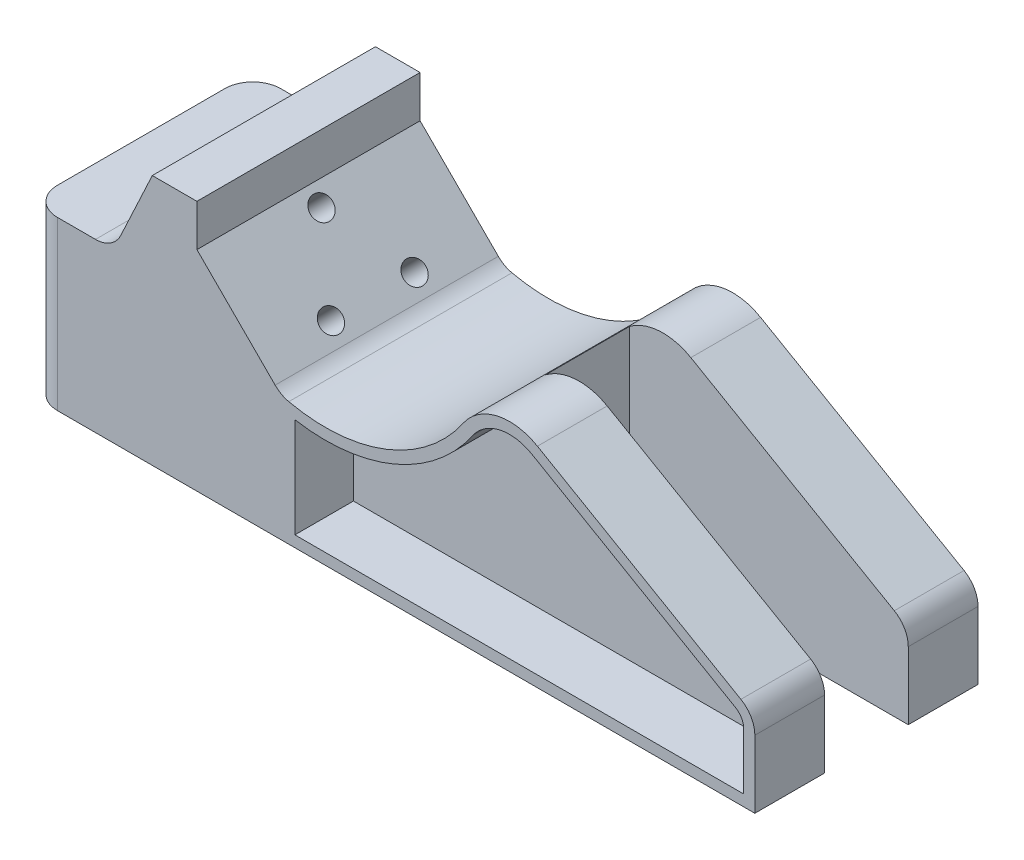
ISO-10303-21;
HEADER;
FILE_DESCRIPTION(('STEP AP214'),'2;1');
FILE_NAME('part.step','',(''),(''),'','','');
FILE_SCHEMA(('AUTOMOTIVE_DESIGN { 1 0 10303 214 1 1 1 1 }'));
ENDSEC;
DATA;
#1=APPLICATION_CONTEXT('core data for automotive mechanical design processes');
#2=APPLICATION_PROTOCOL_DEFINITION('international standard','automotive_design',2000,#1);
#3=PRODUCT_CONTEXT('',#1,'mechanical');
#4=PRODUCT('Part','Part','',(#3));
#5=PRODUCT_RELATED_PRODUCT_CATEGORY('part','',(#4));
#6=PRODUCT_DEFINITION_FORMATION('','',#4);
#7=PRODUCT_DEFINITION_CONTEXT('part definition',#1,'design');
#8=PRODUCT_DEFINITION('design','',#6,#7);
#9=PRODUCT_DEFINITION_SHAPE('','',#8);
#10=(LENGTH_UNIT() NAMED_UNIT(*) SI_UNIT(.MILLI.,.METRE.));
#11=(NAMED_UNIT(*) PLANE_ANGLE_UNIT() SI_UNIT($,.RADIAN.));
#12=(NAMED_UNIT(*) SI_UNIT($,.STERADIAN.) SOLID_ANGLE_UNIT());
#13=UNCERTAINTY_MEASURE_WITH_UNIT(LENGTH_MEASURE(1.E-05),#10,'distance_accuracy_value','');
#14=(GEOMETRIC_REPRESENTATION_CONTEXT(3) GLOBAL_UNCERTAINTY_ASSIGNED_CONTEXT((#13)) GLOBAL_UNIT_ASSIGNED_CONTEXT((#10,
#11,#12)) REPRESENTATION_CONTEXT('',''));
#15=CARTESIAN_POINT('',(0.,0.,0.));
#16=DIRECTION('',(0.,0.,1.));
#17=DIRECTION('',(1.,0.,0.));
#18=AXIS2_PLACEMENT_3D('',#15,#16,#17);
#19=CARTESIAN_POINT('',(0.,12.1132486540517,20.));
#20=DIRECTION('',(-1.,0.,0.));
#21=DIRECTION('',(0.,0.,1.));
#22=AXIS2_PLACEMENT_3D('',#19,#20,#21);
#23=PLANE('',#22);
#24=DIRECTION('',(0.,1.,0.));
#25=VECTOR('',#24,1.);
#26=CARTESIAN_POINT('',(0.,12.1132486540517,-7.5));
#27=LINE('',#26,#25);
#28=CARTESIAN_POINT('',(0.,0.,-7.5));
#29=VERTEX_POINT('',#28);
#30=CARTESIAN_POINT('',(0.,12.1132486540517,-7.5));
#31=VERTEX_POINT('',#30);
#32=EDGE_CURVE('E329',#29,#31,#27,.T.);
#33=ORIENTED_EDGE('',*,*,#32,.F.);
#34=DIRECTION('',(0.,0.,-1.));
#35=VECTOR('',#34,1.);
#36=CARTESIAN_POINT('',(0.,0.,20.));
#37=LINE('',#36,#35);
#38=CARTESIAN_POINT('',(0.,0.,-20.));
#39=VERTEX_POINT('',#38);
#40=EDGE_CURVE('E387',#29,#39,#37,.T.);
#41=ORIENTED_EDGE('',*,*,#40,.T.);
#42=DIRECTION('',(0.,1.,0.));
#43=VECTOR('',#42,1.);
#44=CARTESIAN_POINT('',(0.,12.1132486540517,-20.));
#45=LINE('',#44,#43);
#46=CARTESIAN_POINT('',(0.,12.1132486540517,-20.));
#47=VERTEX_POINT('',#46);
#48=EDGE_CURVE('E345',#39,#47,#45,.T.);
#49=ORIENTED_EDGE('',*,*,#48,.T.);
#50=DIRECTION('',(0.,0.,-1.));
#51=VECTOR('',#50,1.);
#52=CARTESIAN_POINT('',(0.,12.1132486540517,20.));
#53=LINE('',#52,#51);
#54=EDGE_CURVE('E482',#31,#47,#53,.T.);
#55=ORIENTED_EDGE('',*,*,#54,.F.);
#56=EDGE_LOOP('',(#33,#41,#49,#55));
#57=FACE_BOUND('',#56,.T.);
#58=ADVANCED_FACE('F41',(#57),#23,.F.);
#59=CARTESIAN_POINT('',(-5.,12.1132486540517,20.));
#60=DIRECTION('',(0.,0.,-1.));
#61=DIRECTION('',(-1.,0.,0.));
#62=AXIS2_PLACEMENT_3D('',#59,#60,#61);
#63=CYLINDRICAL_SURFACE('',#62,5.);
#64=CARTESIAN_POINT('',(-5.,12.1132486540517,-7.5));
#65=DIRECTION('',(0.,0.,1.));
#66=DIRECTION('',(1.,0.,0.));
#67=AXIS2_PLACEMENT_3D('',#64,#65,#66);
#68=CIRCLE('',#67,5.);
#69=CARTESIAN_POINT('',(-2.50000000000024,16.443375672974,-7.5));
#70=VERTEX_POINT('',#69);
#71=EDGE_CURVE('E332',#31,#70,#68,.T.);
#72=ORIENTED_EDGE('',*,*,#71,.F.);
#73=ORIENTED_EDGE('',*,*,#54,.T.);
#74=CARTESIAN_POINT('',(-5.,12.1132486540517,-20.));
#75=DIRECTION('',(0.,0.,1.));
#76=DIRECTION('',(-1.,0.,0.));
#77=AXIS2_PLACEMENT_3D('',#74,#75,#76);
#78=CIRCLE('',#77,5.);
#79=CARTESIAN_POINT('',(-2.50000000000024,16.443375672974,-20.));
#80=VERTEX_POINT('',#79);
#81=EDGE_CURVE('E391',#47,#80,#78,.T.);
#82=ORIENTED_EDGE('',*,*,#81,.T.);
#83=DIRECTION('',(0.,0.,-1.));
#84=VECTOR('',#83,1.);
#85=CARTESIAN_POINT('',(-2.50000000000024,16.443375672974,20.));
#86=LINE('',#85,#84);
#87=EDGE_CURVE('E477',#70,#80,#86,.T.);
#88=ORIENTED_EDGE('',*,*,#87,.F.);
#89=EDGE_LOOP('',(#72,#73,#82,#88));
#90=FACE_BOUND('',#89,.T.);
#91=ADVANCED_FACE('F645',(#90),#63,.T.);
#92=CARTESIAN_POINT('',(-38.971143170301,37.4999999999977,20.));
#93=DIRECTION('',(-0.49999999999995,-0.866025403784467,0.));
#94=DIRECTION('',(0.866025403784467,-0.49999999999995,0.));
#95=AXIS2_PLACEMENT_3D('',#92,#93,#94);
#96=PLANE('',#95);
#97=DIRECTION('',(-0.866025403784467,0.49999999999995,0.));
#98=VECTOR('',#97,1.);
#99=CARTESIAN_POINT('',(-38.971143170301,37.4999999999977,-7.5));
#100=LINE('',#99,#98);
#101=CARTESIAN_POINT('',(-38.971143170301,37.4999999999977,-7.5));
#102=VERTEX_POINT('',#101);
#103=EDGE_CURVE('E335',#70,#102,#100,.T.);
#104=ORIENTED_EDGE('',*,*,#103,.F.);
#105=ORIENTED_EDGE('',*,*,#87,.T.);
#106=DIRECTION('',(-0.866025403784467,0.49999999999995,0.));
#107=VECTOR('',#106,1.);
#108=CARTESIAN_POINT('',(-38.971143170301,37.4999999999977,-20.));
#109=LINE('',#108,#107);
#110=CARTESIAN_POINT('',(-38.971143170301,37.4999999999978,-20.));
#111=VERTEX_POINT('',#110);
#112=EDGE_CURVE('E395',#80,#111,#109,.T.);
#113=ORIENTED_EDGE('',*,*,#112,.T.);
#114=DIRECTION('',(0.,0.,-1.));
#115=VECTOR('',#114,1.);
#116=CARTESIAN_POINT('',(-38.971143170301,37.4999999999978,20.));
#117=LINE('',#116,#115);
#118=EDGE_CURVE('E472',#102,#111,#117,.T.);
#119=ORIENTED_EDGE('',*,*,#118,.F.);
#120=EDGE_LOOP('',(#104,#105,#113,#119));
#121=FACE_BOUND('',#120,.T.);
#122=ADVANCED_FACE('F640',(#121),#96,.F.);
#123=CARTESIAN_POINT('',(-43.9711431703005,28.8397459621531,20.));
#124=DIRECTION('',(0.,0.,-1.));
#125=DIRECTION('',(-1.,0.,0.));
#126=AXIS2_PLACEMENT_3D('',#123,#124,#125);
#127=CYLINDRICAL_SURFACE('',#126,9.99999999999997);
#128=CARTESIAN_POINT('',(-43.9711431703005,28.8397459621531,-7.5));
#129=DIRECTION('',(0.,0.,1.));
#130=DIRECTION('',(1.,0.,0.));
#131=AXIS2_PLACEMENT_3D('',#128,#129,#130);
#132=CIRCLE('',#131,9.99999999999997);
#133=CARTESIAN_POINT('',(-50.,36.8180217988854,-7.5));
#134=VERTEX_POINT('',#133);
#135=EDGE_CURVE('E338',#102,#134,#132,.T.);
#136=ORIENTED_EDGE('',*,*,#135,.F.);
#137=ORIENTED_EDGE('',*,*,#118,.T.);
#138=CARTESIAN_POINT('',(-43.9711431703005,28.8397459621531,-20.));
#139=DIRECTION('',(0.,0.,1.));
#140=DIRECTION('',(-1.,0.,0.));
#141=AXIS2_PLACEMENT_3D('',#138,#139,#140);
#142=CIRCLE('',#141,9.99999999999997);
#143=CARTESIAN_POINT('',(-52.2270210972418,34.4824828562006,-20.));
#144=VERTEX_POINT('',#143);
#145=EDGE_CURVE('E399',#111,#144,#142,.T.);
#146=ORIENTED_EDGE('',*,*,#145,.T.);
#147=DIRECTION('',(0.,0.,-1.));
#148=VECTOR('',#147,1.);
#149=CARTESIAN_POINT('',(-52.2270210972418,34.4824828562006,20.));
#150=LINE('',#149,#148);
#151=CARTESIAN_POINT('',(-52.2270210972418,34.4824828562006,20.));
#152=VERTEX_POINT('',#151);
#153=EDGE_CURVE('E468',#152,#144,#150,.T.);
#154=ORIENTED_EDGE('',*,*,#153,.F.);
#155=CARTESIAN_POINT('',(-43.9711431703005,28.8397459621531,20.));
#156=DIRECTION('',(0.,0.,1.));
#157=DIRECTION('',(-1.,0.,0.));
#158=AXIS2_PLACEMENT_3D('',#155,#156,#157);
#159=CIRCLE('',#158,9.99999999999997);
#160=CARTESIAN_POINT('',(-38.971143170301,37.4999999999978,20.));
#161=VERTEX_POINT('',#160);
#162=EDGE_CURVE('E357',#161,#152,#159,.T.);
#163=ORIENTED_EDGE('',*,*,#162,.F.);
#164=CARTESIAN_POINT('',(-38.971143170301,37.4999999999977,7.5));
#165=VERTEX_POINT('',#164);
#166=EDGE_CURVE('E473',#161,#165,#117,.T.);
#167=ORIENTED_EDGE('',*,*,#166,.T.);
#168=CARTESIAN_POINT('',(-43.9711431703005,28.8397459621531,7.5));
#169=DIRECTION('',(0.,0.,1.));
#170=DIRECTION('',(1.,0.,0.));
#171=AXIS2_PLACEMENT_3D('',#168,#169,#170);
#172=CIRCLE('',#171,9.99999999999997);
#173=CARTESIAN_POINT('',(-50.,36.8180217988854,7.5));
#174=VERTEX_POINT('',#173);
#175=EDGE_CURVE('E325',#165,#174,#172,.T.);
#176=ORIENTED_EDGE('',*,*,#175,.T.);
#177=DIRECTION('',(0.,0.,-1.));
#178=VECTOR('',#177,1.);
#179=CARTESIAN_POINT('',(-50.,36.8180217988854,20.));
#180=LINE('',#179,#178);
#181=EDGE_CURVE('E341',#174,#134,#180,.T.);
#182=ORIENTED_EDGE('',*,*,#181,.T.);
#183=EDGE_LOOP('',(#136,#137,#146,#154,#163,#167,#176,#182));
#184=FACE_BOUND('',#183,.T.);
#185=ADVANCED_FACE('F635',(#184),#127,.T.);
#186=CARTESIAN_POINT('',(0.,0.,20.));
#187=DIRECTION('',(0.,1.,0.));
#188=DIRECTION('',(-1.,0.,0.));
#189=AXIS2_PLACEMENT_3D('',#186,#187,#188);
#190=PLANE('',#189);
#191=DIRECTION('',(0.,0.,-1.));
#192=VECTOR('',#191,1.);
#193=CARTESIAN_POINT('',(-130.,0.,20.));
#194=LINE('',#193,#192);
#195=CARTESIAN_POINT('',(-130.,0.,15.));
#196=VERTEX_POINT('',#195);
#197=CARTESIAN_POINT('',(-130.,0.,-15.));
#198=VERTEX_POINT('',#197);
#199=EDGE_CURVE('E432',#196,#198,#194,.T.);
#200=ORIENTED_EDGE('',*,*,#199,.T.);
#201=CARTESIAN_POINT('',(-125.,0.,-15.));
#202=DIRECTION('',(0.,1.,0.));
#203=DIRECTION('',(-1.,0.,0.));
#204=AXIS2_PLACEMENT_3D('',#201,#202,#203);
#205=CIRCLE('',#204,5.);
#206=CARTESIAN_POINT('',(-125.,0.,-20.));
#207=VERTEX_POINT('',#206);
#208=EDGE_CURVE('E508',#198,#207,#205,.F.);
#209=ORIENTED_EDGE('',*,*,#208,.T.);
#210=DIRECTION('',(1.,0.,0.));
#211=VECTOR('',#210,1.);
#212=CARTESIAN_POINT('',(0.,0.,-20.));
#213=LINE('',#212,#211);
#214=EDGE_CURVE('E351',#207,#39,#213,.T.);
#215=ORIENTED_EDGE('',*,*,#214,.T.);
#216=ORIENTED_EDGE('',*,*,#40,.F.);
#217=DIRECTION('',(1.,0.,0.));
#218=VECTOR('',#217,1.);
#219=CARTESIAN_POINT('',(0.,0.,-7.5));
#220=LINE('',#219,#218);
#221=CARTESIAN_POINT('',(-50.,0.,-7.5));
#222=VERTEX_POINT('',#221);
#223=EDGE_CURVE('E495',#222,#29,#220,.T.);
#224=ORIENTED_EDGE('',*,*,#223,.F.);
#225=DIRECTION('',(0.,0.,1.));
#226=VECTOR('',#225,1.);
#227=CARTESIAN_POINT('',(-50.,0.,20.));
#228=LINE('',#227,#226);
#229=CARTESIAN_POINT('',(-50.,0.,7.5));
#230=VERTEX_POINT('',#229);
#231=EDGE_CURVE('E491',#222,#230,#228,.T.);
#232=ORIENTED_EDGE('',*,*,#231,.T.);
#233=DIRECTION('',(1.,0.,0.));
#234=VECTOR('',#233,1.);
#235=CARTESIAN_POINT('',(0.,0.,7.5));
#236=LINE('',#235,#234);
#237=CARTESIAN_POINT('',(0.,0.,7.5));
#238=VERTEX_POINT('',#237);
#239=EDGE_CURVE('E487',#230,#238,#236,.T.);
#240=ORIENTED_EDGE('',*,*,#239,.T.);
#241=CARTESIAN_POINT('',(0.,0.,20.));
#242=VERTEX_POINT('',#241);
#243=EDGE_CURVE('E428',#242,#238,#37,.T.);
#244=ORIENTED_EDGE('',*,*,#243,.F.);
#245=DIRECTION('',(1.,0.,0.));
#246=VECTOR('',#245,1.);
#247=CARTESIAN_POINT('',(0.,0.,20.));
#248=LINE('',#247,#246);
#249=CARTESIAN_POINT('',(-125.,0.,20.));
#250=VERTEX_POINT('',#249);
#251=EDGE_CURVE('E384',#250,#242,#248,.T.);
#252=ORIENTED_EDGE('',*,*,#251,.F.);
#253=CARTESIAN_POINT('',(-125.,0.,15.));
#254=DIRECTION('',(0.,1.,0.));
#255=DIRECTION('',(-1.,0.,0.));
#256=AXIS2_PLACEMENT_3D('',#253,#254,#255);
#257=CIRCLE('',#256,5.);
#258=EDGE_CURVE('E505',#250,#196,#257,.F.);
#259=ORIENTED_EDGE('',*,*,#258,.T.);
#260=EDGE_LOOP('',(#200,#209,#215,#216,#224,#232,#240,#244,#252,#259));
#261=FACE_BOUND('',#260,.T.);
#262=ADVANCED_FACE('F525',(#261),#190,.F.);
#263=ORIENTED_EDGE('',*,*,#243,.T.);
#264=DIRECTION('',(0.,1.,0.));
#265=VECTOR('',#264,1.);
#266=CARTESIAN_POINT('',(0.,12.1132486540517,7.5));
#267=LINE('',#266,#265);
#268=CARTESIAN_POINT('',(0.,12.1132486540517,7.5));
#269=VERTEX_POINT('',#268);
#270=EDGE_CURVE('E310',#238,#269,#267,.T.);
#271=ORIENTED_EDGE('',*,*,#270,.T.);
#272=CARTESIAN_POINT('',(0.,12.1132486540517,20.));
#273=VERTEX_POINT('',#272);
#274=EDGE_CURVE('E483',#273,#269,#53,.T.);
#275=ORIENTED_EDGE('',*,*,#274,.F.);
#276=DIRECTION('',(0.,1.,0.));
#277=VECTOR('',#276,1.);
#278=CARTESIAN_POINT('',(0.,12.1132486540517,20.));
#279=LINE('',#278,#277);
#280=EDGE_CURVE('E346',#242,#273,#279,.T.);
#281=ORIENTED_EDGE('',*,*,#280,.F.);
#282=EDGE_LOOP('',(#263,#271,#275,#281));
#283=FACE_BOUND('',#282,.T.);
#284=ADVANCED_FACE('F666',(#283),#23,.F.);
#285=ORIENTED_EDGE('',*,*,#274,.T.);
#286=CARTESIAN_POINT('',(-5.,12.1132486540517,7.5));
#287=DIRECTION('',(0.,0.,1.));
#288=DIRECTION('',(1.,0.,0.));
#289=AXIS2_PLACEMENT_3D('',#286,#287,#288);
#290=CIRCLE('',#289,5.);
#291=CARTESIAN_POINT('',(-2.50000000000024,16.443375672974,7.5));
#292=VERTEX_POINT('',#291);
#293=EDGE_CURVE('E317',#269,#292,#290,.T.);
#294=ORIENTED_EDGE('',*,*,#293,.T.);
#295=CARTESIAN_POINT('',(-2.50000000000024,16.443375672974,20.));
#296=VERTEX_POINT('',#295);
#297=EDGE_CURVE('E478',#296,#292,#86,.T.);
#298=ORIENTED_EDGE('',*,*,#297,.F.);
#299=CARTESIAN_POINT('',(-5.,12.1132486540517,20.));
#300=DIRECTION('',(0.,0.,1.));
#301=DIRECTION('',(-1.,0.,0.));
#302=AXIS2_PLACEMENT_3D('',#299,#300,#301);
#303=CIRCLE('',#302,5.);
#304=EDGE_CURVE('E350',#273,#296,#303,.T.);
#305=ORIENTED_EDGE('',*,*,#304,.F.);
#306=EDGE_LOOP('',(#285,#294,#298,#305));
#307=FACE_BOUND('',#306,.T.);
#308=ADVANCED_FACE('F662',(#307),#63,.T.);
#309=ORIENTED_EDGE('',*,*,#297,.T.);
#310=DIRECTION('',(-0.866025403784467,0.49999999999995,0.));
#311=VECTOR('',#310,1.);
#312=CARTESIAN_POINT('',(-38.971143170301,37.4999999999977,7.5));
#313=LINE('',#312,#311);
#314=EDGE_CURVE('E321',#292,#165,#313,.T.);
#315=ORIENTED_EDGE('',*,*,#314,.T.);
#316=ORIENTED_EDGE('',*,*,#166,.F.);
#317=DIRECTION('',(-0.866025403784467,0.49999999999995,0.));
#318=VECTOR('',#317,1.);
#319=CARTESIAN_POINT('',(-38.971143170301,37.4999999999977,20.));
#320=LINE('',#319,#318);
#321=EDGE_CURVE('E354',#296,#161,#320,.T.);
#322=ORIENTED_EDGE('',*,*,#321,.F.);
#323=EDGE_LOOP('',(#309,#315,#316,#322));
#324=FACE_BOUND('',#323,.T.);
#325=ADVANCED_FACE('F659',(#324),#96,.F.);
#326=CARTESIAN_POINT('',(-76.9946548780654,51.410693538343,20.));
#327=DIRECTION('',(0.,0.,-1.));
#328=DIRECTION('',(-1.,0.,0.));
#329=AXIS2_PLACEMENT_3D('',#326,#327,#328);
#330=CYLINDRICAL_SURFACE('',#329,30.);
#331=CARTESIAN_POINT('',(-76.9946548780654,51.410693538343,-20.));
#332=DIRECTION('',(0.,0.,-1.));
#333=DIRECTION('',(1.,0.,0.));
#334=AXIS2_PLACEMENT_3D('',#331,#332,#333);
#335=CIRCLE('',#334,30.);
#336=CARTESIAN_POINT('',(-83.5371840330029,22.1327955219759,-20.));
#337=VERTEX_POINT('',#336);
#338=EDGE_CURVE('E402',#144,#337,#335,.T.);
#339=ORIENTED_EDGE('',*,*,#338,.T.);
#340=DIRECTION('',(0.,0.,-1.));
#341=VECTOR('',#340,1.);
#342=CARTESIAN_POINT('',(-83.5371840330029,22.1327955219759,20.));
#343=LINE('',#342,#341);
#344=CARTESIAN_POINT('',(-83.5371840330029,22.1327955219759,20.));
#345=VERTEX_POINT('',#344);
#346=EDGE_CURVE('E464',#345,#337,#343,.T.);
#347=ORIENTED_EDGE('',*,*,#346,.F.);
#348=CARTESIAN_POINT('',(-76.9946548780654,51.410693538343,20.));
#349=DIRECTION('',(0.,0.,-1.));
#350=DIRECTION('',(1.,0.,0.));
#351=AXIS2_PLACEMENT_3D('',#348,#349,#350);
#352=CIRCLE('',#351,30.);
#353=EDGE_CURVE('E360',#152,#345,#352,.T.);
#354=ORIENTED_EDGE('',*,*,#353,.F.);
#355=ORIENTED_EDGE('',*,*,#153,.T.);
#356=EDGE_LOOP('',(#339,#347,#354,#355));
#357=FACE_BOUND('',#356,.T.);
#358=ADVANCED_FACE('F630',(#357),#330,.F.);
#359=CARTESIAN_POINT('',(-82.44676250718,27.0124451913704,20.));
#360=DIRECTION('',(0.,0.,-1.));
#361=DIRECTION('',(-1.,0.,0.));
#362=AXIS2_PLACEMENT_3D('',#359,#360,#361);
#363=CYLINDRICAL_SURFACE('',#362,5.);
#364=CARTESIAN_POINT('',(-82.44676250718,27.0124451913704,-20.));
#365=DIRECTION('',(0.,0.,-1.));
#366=DIRECTION('',(1.,0.,0.));
#367=AXIS2_PLACEMENT_3D('',#364,#365,#366);
#368=CIRCLE('',#367,5.);
#369=CARTESIAN_POINT('',(-85.9822964131127,23.4769112854377,-20.));
#370=VERTEX_POINT('',#369);
#371=EDGE_CURVE('E405',#337,#370,#368,.T.);
#372=ORIENTED_EDGE('',*,*,#371,.T.);
#373=DIRECTION('',(0.,0.,-1.));
#374=VECTOR('',#373,1.);
#375=CARTESIAN_POINT('',(-85.9822964131127,23.4769112854377,20.));
#376=LINE('',#375,#374);
#377=CARTESIAN_POINT('',(-85.9822964131127,23.4769112854377,20.));
#378=VERTEX_POINT('',#377);
#379=EDGE_CURVE('E460',#378,#370,#376,.T.);
#380=ORIENTED_EDGE('',*,*,#379,.F.);
#381=CARTESIAN_POINT('',(-82.44676250718,27.0124451913704,20.));
#382=DIRECTION('',(0.,0.,-1.));
#383=DIRECTION('',(1.,0.,0.));
#384=AXIS2_PLACEMENT_3D('',#381,#382,#383);
#385=CIRCLE('',#384,5.);
#386=EDGE_CURVE('E363',#345,#378,#385,.T.);
#387=ORIENTED_EDGE('',*,*,#386,.F.);
#388=ORIENTED_EDGE('',*,*,#346,.T.);
#389=EDGE_LOOP('',(#372,#380,#387,#388));
#390=FACE_BOUND('',#389,.T.);
#391=ADVANCED_FACE('F596',(#390),#363,.F.);
#392=CARTESIAN_POINT('',(-100.005385127675,37.5,20.));
#393=DIRECTION('',(-0.707106781186547,-0.707106781186548,0.));
#394=DIRECTION('',(0.707106781186548,-0.707106781186547,0.));
#395=AXIS2_PLACEMENT_3D('',#392,#393,#394);
#396=PLANE('',#395);
#397=CARTESIAN_POINT('',(-88.4863462143226,25.9809610866475,-7.5));
#398=DIRECTION('',(0.707106781186547,0.707106781186548,0.));
#399=DIRECTION('',(-0.707106781186548,0.707106781186547,0.));
#400=AXIS2_PLACEMENT_3D('',#397,#398,#399);
#401=CIRCLE('',#400,2.);
#402=CARTESIAN_POINT('',(-89.9005597766956,27.3951746490206,-7.5));
#403=VERTEX_POINT('',#402);
#404=EDGE_CURVE('E567',#403,#403,#401,.T.);
#405=ORIENTED_EDGE('',*,*,#404,.F.);
#406=EDGE_LOOP('',(#405));
#407=FACE_BOUND('',#406,.T.);
#408=CARTESIAN_POINT('',(-88.4863462143226,25.9809610866475,7.5));
#409=DIRECTION('',(0.707106781186547,0.707106781186548,0.));
#410=DIRECTION('',(-0.707106781186548,0.707106781186547,0.));
#411=AXIS2_PLACEMENT_3D('',#408,#409,#410);
#412=CIRCLE('',#411,2.);
#413=CARTESIAN_POINT('',(-89.9005597766956,27.3951746490206,7.5));
#414=VERTEX_POINT('',#413);
#415=EDGE_CURVE('E575',#414,#414,#412,.T.);
#416=ORIENTED_EDGE('',*,*,#415,.F.);
#417=EDGE_LOOP('',(#416));
#418=FACE_BOUND('',#417,.T.);
#419=CARTESIAN_POINT('',(-97.6719327497595,35.1665476220844,0.));
#420=DIRECTION('',(0.707106781186547,0.707106781186548,0.));
#421=DIRECTION('',(-0.707106781186548,0.707106781186547,0.));
#422=AXIS2_PLACEMENT_3D('',#419,#420,#421);
#423=CIRCLE('',#422,2.);
#424=CARTESIAN_POINT('',(-99.0861463121326,36.5807611844575,0.));
#425=VERTEX_POINT('',#424);
#426=EDGE_CURVE('E554',#425,#425,#423,.T.);
#427=ORIENTED_EDGE('',*,*,#426,.F.);
#428=EDGE_LOOP('',(#427));
#429=FACE_BOUND('',#428,.T.);
#430=DIRECTION('',(-0.707106781186548,0.707106781186547,0.));
#431=VECTOR('',#430,1.);
#432=CARTESIAN_POINT('',(-100.005385127675,37.5,-20.));
#433=LINE('',#432,#431);
#434=CARTESIAN_POINT('',(-100.005385127675,37.5,-20.));
#435=VERTEX_POINT('',#434);
#436=EDGE_CURVE('E408',#370,#435,#433,.T.);
#437=ORIENTED_EDGE('',*,*,#436,.T.);
#438=DIRECTION('',(0.,0.,-1.));
#439=VECTOR('',#438,1.);
#440=CARTESIAN_POINT('',(-100.005385127675,37.5,20.));
#441=LINE('',#440,#439);
#442=CARTESIAN_POINT('',(-100.005385127675,37.5,20.));
#443=VERTEX_POINT('',#442);
#444=EDGE_CURVE('E456',#443,#435,#441,.T.);
#445=ORIENTED_EDGE('',*,*,#444,.F.);
#446=DIRECTION('',(-0.707106781186548,0.707106781186547,0.));
#447=VECTOR('',#446,1.);
#448=CARTESIAN_POINT('',(-100.005385127675,37.5,20.));
#449=LINE('',#448,#447);
#450=EDGE_CURVE('E366',#378,#443,#449,.T.);
#451=ORIENTED_EDGE('',*,*,#450,.F.);
#452=ORIENTED_EDGE('',*,*,#379,.T.);
#453=EDGE_LOOP('',(#437,#445,#451,#452));
#454=FACE_BOUND('',#453,.T.);
#455=ADVANCED_FACE('F592',(#407,#418,#429,#454),#396,.F.);
#456=CARTESIAN_POINT('',(-100.005385127675,45.,20.));
#457=DIRECTION('',(-1.,0.,0.));
#458=DIRECTION('',(0.,0.,1.));
#459=AXIS2_PLACEMENT_3D('',#456,#457,#458);
#460=PLANE('',#459);
#461=DIRECTION('',(0.,1.,0.));
#462=VECTOR('',#461,1.);
#463=CARTESIAN_POINT('',(-100.005385127675,45.,-20.));
#464=LINE('',#463,#462);
#465=CARTESIAN_POINT('',(-100.005385127675,45.,-20.));
#466=VERTEX_POINT('',#465);
#467=EDGE_CURVE('E411',#435,#466,#464,.T.);
#468=ORIENTED_EDGE('',*,*,#467,.T.);
#469=DIRECTION('',(0.,0.,-1.));
#470=VECTOR('',#469,1.);
#471=CARTESIAN_POINT('',(-100.005385127675,45.,20.));
#472=LINE('',#471,#470);
#473=CARTESIAN_POINT('',(-100.005385127675,45.,20.));
#474=VERTEX_POINT('',#473);
#475=EDGE_CURVE('E452',#474,#466,#472,.T.);
#476=ORIENTED_EDGE('',*,*,#475,.F.);
#477=DIRECTION('',(0.,1.,0.));
#478=VECTOR('',#477,1.);
#479=CARTESIAN_POINT('',(-100.005385127675,45.,20.));
#480=LINE('',#479,#478);
#481=EDGE_CURVE('E369',#443,#474,#480,.T.);
#482=ORIENTED_EDGE('',*,*,#481,.F.);
#483=ORIENTED_EDGE('',*,*,#444,.T.);
#484=EDGE_LOOP('',(#468,#476,#482,#483));
#485=FACE_BOUND('',#484,.T.);
#486=ADVANCED_FACE('F595',(#485),#460,.F.);
#487=CARTESIAN_POINT('',(-108.005385127675,45.,20.));
#488=DIRECTION('',(0.,-1.,0.));
#489=DIRECTION('',(0.,0.,-1.));
#490=AXIS2_PLACEMENT_3D('',#487,#488,#489);
#491=PLANE('',#490);
#492=DIRECTION('',(-1.,0.,0.));
#493=VECTOR('',#492,1.);
#494=CARTESIAN_POINT('',(-108.005385127675,45.,-20.));
#495=LINE('',#494,#493);
#496=CARTESIAN_POINT('',(-108.005385127675,45.,-20.));
#497=VERTEX_POINT('',#496);
#498=EDGE_CURVE('E414',#466,#497,#495,.T.);
#499=ORIENTED_EDGE('',*,*,#498,.T.);
#500=DIRECTION('',(0.,0.,-1.));
#501=VECTOR('',#500,1.);
#502=CARTESIAN_POINT('',(-108.005385127675,45.,20.));
#503=LINE('',#502,#501);
#504=CARTESIAN_POINT('',(-108.005385127675,45.,20.));
#505=VERTEX_POINT('',#504);
#506=EDGE_CURVE('E448',#505,#497,#503,.T.);
#507=ORIENTED_EDGE('',*,*,#506,.F.);
#508=DIRECTION('',(-1.,0.,0.));
#509=VECTOR('',#508,1.);
#510=CARTESIAN_POINT('',(-108.005385127675,45.,20.));
#511=LINE('',#510,#509);
#512=EDGE_CURVE('E372',#474,#505,#511,.T.);
#513=ORIENTED_EDGE('',*,*,#512,.F.);
#514=ORIENTED_EDGE('',*,*,#475,.T.);
#515=EDGE_LOOP('',(#499,#507,#513,#514));
#516=FACE_BOUND('',#515,.T.);
#517=ADVANCED_FACE('F615',(#516),#491,.F.);
#518=CARTESIAN_POINT('',(-113.653812368854,32.8869086912965,20.));
#519=DIRECTION('',(0.906307787036651,-0.422618261740698,0.));
#520=DIRECTION('',(0.422618261740698,0.906307787036651,0.));
#521=AXIS2_PLACEMENT_3D('',#518,#519,#520);
#522=PLANE('',#521);
#523=DIRECTION('',(-0.422618261740698,-0.906307787036651,0.));
#524=VECTOR('',#523,1.);
#525=CARTESIAN_POINT('',(-113.653812368854,32.8869086912965,-20.));
#526=LINE('',#525,#524);
#527=CARTESIAN_POINT('',(-113.653812368854,32.8869086912965,-20.));
#528=VERTEX_POINT('',#527);
#529=EDGE_CURVE('E417',#497,#528,#526,.T.);
#530=ORIENTED_EDGE('',*,*,#529,.T.);
#531=DIRECTION('',(0.,0.,-1.));
#532=VECTOR('',#531,1.);
#533=CARTESIAN_POINT('',(-113.653812368854,32.8869086912965,20.));
#534=LINE('',#533,#532);
#535=CARTESIAN_POINT('',(-113.653812368854,32.8869086912965,20.));
#536=VERTEX_POINT('',#535);
#537=EDGE_CURVE('E444',#536,#528,#534,.T.);
#538=ORIENTED_EDGE('',*,*,#537,.F.);
#539=DIRECTION('',(-0.422618261740698,-0.906307787036651,0.));
#540=VECTOR('',#539,1.);
#541=CARTESIAN_POINT('',(-113.653812368854,32.8869086912965,20.));
#542=LINE('',#541,#540);
#543=EDGE_CURVE('E375',#505,#536,#542,.T.);
#544=ORIENTED_EDGE('',*,*,#543,.F.);
#545=ORIENTED_EDGE('',*,*,#506,.T.);
#546=EDGE_LOOP('',(#530,#538,#544,#545));
#547=FACE_BOUND('',#546,.T.);
#548=ADVANCED_FACE('F619',(#547),#522,.F.);
#549=CARTESIAN_POINT('',(-118.185351304037,35.,20.));
#550=DIRECTION('',(0.,0.,-1.));
#551=DIRECTION('',(-1.,0.,0.));
#552=AXIS2_PLACEMENT_3D('',#549,#550,#551);
#553=CYLINDRICAL_SURFACE('',#552,5.);
#554=CARTESIAN_POINT('',(-118.185351304037,35.,-20.));
#555=DIRECTION('',(0.,0.,-1.));
#556=DIRECTION('',(-1.,0.,0.));
#557=AXIS2_PLACEMENT_3D('',#554,#555,#556);
#558=CIRCLE('',#557,5.);
#559=CARTESIAN_POINT('',(-118.185351304037,30.,-20.));
#560=VERTEX_POINT('',#559);
#561=EDGE_CURVE('E420',#528,#560,#558,.T.);
#562=ORIENTED_EDGE('',*,*,#561,.T.);
#563=DIRECTION('',(0.,0.,-1.));
#564=VECTOR('',#563,1.);
#565=CARTESIAN_POINT('',(-118.185351304037,30.,20.));
#566=LINE('',#565,#564);
#567=CARTESIAN_POINT('',(-118.185351304037,30.,20.));
#568=VERTEX_POINT('',#567);
#569=EDGE_CURVE('E440',#568,#560,#566,.T.);
#570=ORIENTED_EDGE('',*,*,#569,.F.);
#571=CARTESIAN_POINT('',(-118.185351304037,35.,20.));
#572=DIRECTION('',(0.,0.,-1.));
#573=DIRECTION('',(-1.,0.,0.));
#574=AXIS2_PLACEMENT_3D('',#571,#572,#573);
#575=CIRCLE('',#574,5.);
#576=EDGE_CURVE('E378',#536,#568,#575,.T.);
#577=ORIENTED_EDGE('',*,*,#576,.F.);
#578=ORIENTED_EDGE('',*,*,#537,.T.);
#579=EDGE_LOOP('',(#562,#570,#577,#578));
#580=FACE_BOUND('',#579,.T.);
#581=ADVANCED_FACE('F702',(#580),#553,.F.);
#582=CARTESIAN_POINT('',(-130.,30.,20.));
#583=DIRECTION('',(0.,-1.,0.));
#584=DIRECTION('',(1.,0.,0.));
#585=AXIS2_PLACEMENT_3D('',#582,#583,#584);
#586=PLANE('',#585);
#587=DIRECTION('',(-1.,0.,0.));
#588=VECTOR('',#587,1.);
#589=CARTESIAN_POINT('',(-130.,30.,-20.));
#590=LINE('',#589,#588);
#591=CARTESIAN_POINT('',(-125.,30.,-20.));
#592=VERTEX_POINT('',#591);
#593=EDGE_CURVE('E423',#560,#592,#590,.T.);
#594=ORIENTED_EDGE('',*,*,#593,.T.);
#595=CARTESIAN_POINT('',(-125.,30.,-15.));
#596=DIRECTION('',(0.,-1.,0.));
#597=DIRECTION('',(1.,0.,0.));
#598=AXIS2_PLACEMENT_3D('',#595,#596,#597);
#599=CIRCLE('',#598,5.);
#600=CARTESIAN_POINT('',(-130.,30.,-15.));
#601=VERTEX_POINT('',#600);
#602=EDGE_CURVE('E50',#592,#601,#599,.F.);
#603=ORIENTED_EDGE('',*,*,#602,.T.);
#604=DIRECTION('',(0.,0.,-1.));
#605=VECTOR('',#604,1.);
#606=CARTESIAN_POINT('',(-130.,30.,20.));
#607=LINE('',#606,#605);
#608=CARTESIAN_POINT('',(-130.,30.,15.));
#609=VERTEX_POINT('',#608);
#610=EDGE_CURVE('E436',#609,#601,#607,.T.);
#611=ORIENTED_EDGE('',*,*,#610,.F.);
#612=CARTESIAN_POINT('',(-125.,30.,15.));
#613=DIRECTION('',(0.,-1.,0.));
#614=DIRECTION('',(1.,0.,0.));
#615=AXIS2_PLACEMENT_3D('',#612,#613,#614);
#616=CIRCLE('',#615,5.);
#617=CARTESIAN_POINT('',(-125.,30.,20.));
#618=VERTEX_POINT('',#617);
#619=EDGE_CURVE('E57',#609,#618,#616,.F.);
#620=ORIENTED_EDGE('',*,*,#619,.T.);
#621=DIRECTION('',(-1.,0.,0.));
#622=VECTOR('',#621,1.);
#623=CARTESIAN_POINT('',(-130.,30.,20.));
#624=LINE('',#623,#622);
#625=EDGE_CURVE('E381',#568,#618,#624,.T.);
#626=ORIENTED_EDGE('',*,*,#625,.F.);
#627=ORIENTED_EDGE('',*,*,#569,.T.);
#628=EDGE_LOOP('',(#594,#603,#611,#620,#626,#627));
#629=FACE_BOUND('',#628,.T.);
#630=ADVANCED_FACE('F516',(#629),#586,.F.);
#631=CARTESIAN_POINT('',(-130.,0.,20.));
#632=DIRECTION('',(1.,0.,0.));
#633=DIRECTION('',(0.,0.,-1.));
#634=AXIS2_PLACEMENT_3D('',#631,#632,#633);
#635=PLANE('',#634);
#636=ORIENTED_EDGE('',*,*,#610,.T.);
#637=DIRECTION('',(0.,-1.,0.));
#638=VECTOR('',#637,1.);
#639=CARTESIAN_POINT('',(-130.,0.,-15.));
#640=LINE('',#639,#638);
#641=EDGE_CURVE('E501',#601,#198,#640,.T.);
#642=ORIENTED_EDGE('',*,*,#641,.T.);
#643=ORIENTED_EDGE('',*,*,#199,.F.);
#644=DIRECTION('',(0.,-1.,0.));
#645=VECTOR('',#644,1.);
#646=CARTESIAN_POINT('',(-130.,0.,15.));
#647=LINE('',#646,#645);
#648=EDGE_CURVE('E498',#196,#609,#647,.F.);
#649=ORIENTED_EDGE('',*,*,#648,.T.);
#650=EDGE_LOOP('',(#636,#642,#643,#649));
#651=FACE_BOUND('',#650,.T.);
#652=ADVANCED_FACE('F520',(#651),#635,.F.);
#653=CARTESIAN_POINT('',(-118.185351304037,35.,20.));
#654=DIRECTION('',(0.,0.,-1.));
#655=DIRECTION('',(-1.,0.,0.));
#656=AXIS2_PLACEMENT_3D('',#653,#654,#655);
#657=PLANE('',#656);
#658=DIRECTION('',(0.,1.,0.));
#659=VECTOR('',#658,1.);
#660=CARTESIAN_POINT('',(-2.,2.,20.));
#661=LINE('',#660,#659);
#662=CARTESIAN_POINT('',(-2.,2.,20.));
#663=VERTEX_POINT('',#662);
#664=CARTESIAN_POINT('',(-2.,12.1132486540517,20.));
#665=VERTEX_POINT('',#664);
#666=EDGE_CURVE('E254',#663,#665,#661,.T.);
#667=ORIENTED_EDGE('',*,*,#666,.F.);
#668=DIRECTION('',(1.,0.,0.));
#669=VECTOR('',#668,1.);
#670=CARTESIAN_POINT('',(-82.44676250718,1.99999999999999,20.));
#671=LINE('',#670,#669);
#672=CARTESIAN_POINT('',(-82.44676250718,1.99999999999999,20.));
#673=VERTEX_POINT('',#672);
#674=EDGE_CURVE('E260',#673,#663,#671,.T.);
#675=ORIENTED_EDGE('',*,*,#674,.F.);
#676=DIRECTION('',(0.,-1.,0.));
#677=VECTOR('',#676,1.);
#678=CARTESIAN_POINT('',(-82.44676250718,1.99999999999999,20.));
#679=LINE('',#678,#677);
#680=CARTESIAN_POINT('',(-82.44676250718,19.878574637125,20.));
#681=VERTEX_POINT('',#680);
#682=EDGE_CURVE('E281',#681,#673,#679,.T.);
#683=ORIENTED_EDGE('',*,*,#682,.F.);
#684=CARTESIAN_POINT('',(-76.9946548780654,51.410693538343,20.));
#685=DIRECTION('',(0.,0.,-1.));
#686=DIRECTION('',(1.,0.,0.));
#687=AXIS2_PLACEMENT_3D('',#684,#685,#686);
#688=CIRCLE('',#687,32.);
#689=CARTESIAN_POINT('',(-50.5758455118535,33.3539354773911,20.));
#690=VERTEX_POINT('',#689);
#691=EDGE_CURVE('E277',#690,#681,#688,.T.);
#692=ORIENTED_EDGE('',*,*,#691,.F.);
#693=CARTESIAN_POINT('',(-43.9711431703005,28.8397459621531,20.));
#694=DIRECTION('',(0.,0.,1.));
#695=DIRECTION('',(1.,0.,0.));
#696=AXIS2_PLACEMENT_3D('',#693,#694,#695);
#697=CIRCLE('',#696,7.99999999999998);
#698=CARTESIAN_POINT('',(-39.9711431703009,35.7679491924288,20.));
#699=VERTEX_POINT('',#698);
#700=EDGE_CURVE('E270',#699,#690,#697,.T.);
#701=ORIENTED_EDGE('',*,*,#700,.F.);
#702=DIRECTION('',(-0.866025403784467,0.49999999999995,0.));
#703=VECTOR('',#702,1.);
#704=CARTESIAN_POINT('',(-3.50000000000014,14.7113248654051,20.));
#705=LINE('',#704,#703);
#706=CARTESIAN_POINT('',(-3.50000000000014,14.7113248654051,20.));
#707=VERTEX_POINT('',#706);
#708=EDGE_CURVE('E266',#707,#699,#705,.T.);
#709=ORIENTED_EDGE('',*,*,#708,.F.);
#710=CARTESIAN_POINT('',(-5.,12.1132486540517,20.));
#711=DIRECTION('',(0.,0.,1.));
#712=DIRECTION('',(1.,0.,0.));
#713=AXIS2_PLACEMENT_3D('',#710,#711,#712);
#714=CIRCLE('',#713,3.);
#715=EDGE_CURVE('E242',#665,#707,#714,.T.);
#716=ORIENTED_EDGE('',*,*,#715,.F.);
#717=EDGE_LOOP('',(#667,#675,#683,#692,#701,#709,#716));
#718=FACE_BOUND('',#717,.T.);
#719=ORIENTED_EDGE('',*,*,#625,.T.);
#720=DIRECTION('',(0.,-1.,0.));
#721=VECTOR('',#720,1.);
#722=CARTESIAN_POINT('',(-125.,35.,20.));
#723=LINE('',#722,#721);
#724=EDGE_CURVE('E12',#618,#250,#723,.T.);
#725=ORIENTED_EDGE('',*,*,#724,.T.);
#726=ORIENTED_EDGE('',*,*,#251,.T.);
#727=ORIENTED_EDGE('',*,*,#280,.T.);
#728=ORIENTED_EDGE('',*,*,#304,.T.);
#729=ORIENTED_EDGE('',*,*,#321,.T.);
#730=ORIENTED_EDGE('',*,*,#162,.T.);
#731=ORIENTED_EDGE('',*,*,#353,.T.);
#732=ORIENTED_EDGE('',*,*,#386,.T.);
#733=ORIENTED_EDGE('',*,*,#450,.T.);
#734=ORIENTED_EDGE('',*,*,#481,.T.);
#735=ORIENTED_EDGE('',*,*,#512,.T.);
#736=ORIENTED_EDGE('',*,*,#543,.T.);
#737=ORIENTED_EDGE('',*,*,#576,.T.);
#738=EDGE_LOOP('',(#719,#725,#726,#727,#728,#729,#730,#731,#732,#733,#734,#735,#736,#737));
#739=FACE_BOUND('',#738,.T.);
#740=ADVANCED_FACE('F262',(#718,#739),#657,.F.);
#741=CARTESIAN_POINT('',(-118.185351304037,35.,-20.));
#742=DIRECTION('',(0.,0.,-1.));
#743=DIRECTION('',(-1.,0.,0.));
#744=AXIS2_PLACEMENT_3D('',#741,#742,#743);
#745=PLANE('',#744);
#746=ORIENTED_EDGE('',*,*,#214,.F.);
#747=DIRECTION('',(0.,-1.,0.));
#748=VECTOR('',#747,1.);
#749=CARTESIAN_POINT('',(-125.,30.,-20.));
#750=LINE('',#749,#748);
#751=EDGE_CURVE('E65',#207,#592,#750,.F.);
#752=ORIENTED_EDGE('',*,*,#751,.T.);
#753=ORIENTED_EDGE('',*,*,#593,.F.);
#754=ORIENTED_EDGE('',*,*,#561,.F.);
#755=ORIENTED_EDGE('',*,*,#529,.F.);
#756=ORIENTED_EDGE('',*,*,#498,.F.);
#757=ORIENTED_EDGE('',*,*,#467,.F.);
#758=ORIENTED_EDGE('',*,*,#436,.F.);
#759=ORIENTED_EDGE('',*,*,#371,.F.);
#760=ORIENTED_EDGE('',*,*,#338,.F.);
#761=ORIENTED_EDGE('',*,*,#145,.F.);
#762=ORIENTED_EDGE('',*,*,#112,.F.);
#763=ORIENTED_EDGE('',*,*,#81,.F.);
#764=ORIENTED_EDGE('',*,*,#48,.F.);
#765=EDGE_LOOP('',(#746,#752,#753,#754,#755,#756,#757,#758,#759,#760,#761,#762,#763,#764));
#766=FACE_BOUND('',#765,.T.);
#767=ADVANCED_FACE('F529',(#766),#745,.T.);
#768=CARTESIAN_POINT('',(-50.,67.5636546901374,-7.5));
#769=DIRECTION('',(-1.,0.,0.));
#770=DIRECTION('',(0.,-1.,0.));
#771=AXIS2_PLACEMENT_3D('',#768,#769,#770);
#772=PLANE('',#771);
#773=DIRECTION('',(0.,-1.,0.));
#774=VECTOR('',#773,1.);
#775=CARTESIAN_POINT('',(-50.,67.5636546901374,7.5));
#776=LINE('',#775,#774);
#777=EDGE_CURVE('E304',#174,#230,#776,.T.);
#778=ORIENTED_EDGE('',*,*,#777,.T.);
#779=ORIENTED_EDGE('',*,*,#231,.F.);
#780=DIRECTION('',(0.,-1.,0.));
#781=VECTOR('',#780,1.);
#782=CARTESIAN_POINT('',(-50.,67.5636546901374,-7.5));
#783=LINE('',#782,#781);
#784=EDGE_CURVE('E306',#134,#222,#783,.T.);
#785=ORIENTED_EDGE('',*,*,#784,.F.);
#786=ORIENTED_EDGE('',*,*,#181,.F.);
#787=EDGE_LOOP('',(#778,#779,#785,#786));
#788=FACE_BOUND('',#787,.T.);
#789=ADVANCED_FACE('F652',(#788),#772,.F.);
#790=CARTESIAN_POINT('',(0.,0.,-7.5));
#791=DIRECTION('',(0.,0.,1.));
#792=DIRECTION('',(1.,0.,0.));
#793=AXIS2_PLACEMENT_3D('',#790,#791,#792);
#794=PLANE('',#793);
#795=ORIENTED_EDGE('',*,*,#135,.T.);
#796=ORIENTED_EDGE('',*,*,#784,.T.);
#797=ORIENTED_EDGE('',*,*,#223,.T.);
#798=ORIENTED_EDGE('',*,*,#32,.T.);
#799=ORIENTED_EDGE('',*,*,#71,.T.);
#800=ORIENTED_EDGE('',*,*,#103,.T.);
#801=EDGE_LOOP('',(#795,#796,#797,#798,#799,#800));
#802=FACE_BOUND('',#801,.T.);
#803=ADVANCED_FACE('F648',(#802),#794,.T.);
#804=CARTESIAN_POINT('',(0.,0.,7.5));
#805=DIRECTION('',(0.,0.,1.));
#806=DIRECTION('',(1.,0.,0.));
#807=AXIS2_PLACEMENT_3D('',#804,#805,#806);
#808=PLANE('',#807);
#809=ORIENTED_EDGE('',*,*,#314,.F.);
#810=ORIENTED_EDGE('',*,*,#293,.F.);
#811=ORIENTED_EDGE('',*,*,#270,.F.);
#812=ORIENTED_EDGE('',*,*,#239,.F.);
#813=ORIENTED_EDGE('',*,*,#777,.F.);
#814=ORIENTED_EDGE('',*,*,#175,.F.);
#815=EDGE_LOOP('',(#809,#810,#811,#812,#813,#814));
#816=FACE_BOUND('',#815,.T.);
#817=ADVANCED_FACE('F655',(#816),#808,.F.);
#818=CARTESIAN_POINT('',(-82.44676250718,1.99999999999999,-80.1669236177134));
#819=DIRECTION('',(0.,-1.,0.));
#820=DIRECTION('',(1.,0.,0.));
#821=AXIS2_PLACEMENT_3D('',#818,#819,#820);
#822=PLANE('',#821);
#823=DIRECTION('',(-1.,0.,0.));
#824=VECTOR('',#823,1.);
#825=CARTESIAN_POINT('',(-82.44676250718,1.99999999999999,9.49999999999999));
#826=LINE('',#825,#824);
#827=CARTESIAN_POINT('',(-2.,2.,9.49999999999999));
#828=VERTEX_POINT('',#827);
#829=CARTESIAN_POINT('',(-82.44676250718,1.99999999999999,9.49999999999999));
#830=VERTEX_POINT('',#829);
#831=EDGE_CURVE('E305',#828,#830,#826,.T.);
#832=ORIENTED_EDGE('',*,*,#831,.T.);
#833=DIRECTION('',(0.,0.,1.));
#834=VECTOR('',#833,1.);
#835=CARTESIAN_POINT('',(-82.44676250718,1.99999999999999,-80.1669236177134));
#836=LINE('',#835,#834);
#837=EDGE_CURVE('E285',#830,#673,#836,.T.);
#838=ORIENTED_EDGE('',*,*,#837,.T.);
#839=ORIENTED_EDGE('',*,*,#674,.T.);
#840=DIRECTION('',(0.,0.,1.));
#841=VECTOR('',#840,1.);
#842=CARTESIAN_POINT('',(-2.,2.,-80.1669236177134));
#843=LINE('',#842,#841);
#844=EDGE_CURVE('E250',#828,#663,#843,.T.);
#845=ORIENTED_EDGE('',*,*,#844,.F.);
#846=EDGE_LOOP('',(#832,#838,#839,#845));
#847=FACE_BOUND('',#846,.T.);
#848=ADVANCED_FACE('F771',(#847),#822,.F.);
#849=CARTESIAN_POINT('',(-82.44676250718,1.99999999999999,-80.1669236177134));
#850=DIRECTION('',(-1.,0.,0.));
#851=DIRECTION('',(0.,0.,1.));
#852=AXIS2_PLACEMENT_3D('',#849,#850,#851);
#853=PLANE('',#852);
#854=DIRECTION('',(0.,1.,0.));
#855=VECTOR('',#854,1.);
#856=CARTESIAN_POINT('',(-82.44676250718,1.99999999999999,9.49999999999999));
#857=LINE('',#856,#855);
#858=CARTESIAN_POINT('',(-82.44676250718,19.878574637125,9.49999999999999));
#859=VERTEX_POINT('',#858);
#860=EDGE_CURVE('E539',#830,#859,#857,.T.);
#861=ORIENTED_EDGE('',*,*,#860,.T.);
#862=DIRECTION('',(0.,0.,1.));
#863=VECTOR('',#862,1.);
#864=CARTESIAN_POINT('',(-82.44676250718,19.878574637125,-80.1669236177134));
#865=LINE('',#864,#863);
#866=EDGE_CURVE('E288',#859,#681,#865,.T.);
#867=ORIENTED_EDGE('',*,*,#866,.T.);
#868=ORIENTED_EDGE('',*,*,#682,.T.);
#869=ORIENTED_EDGE('',*,*,#837,.F.);
#870=EDGE_LOOP('',(#861,#867,#868,#869));
#871=FACE_BOUND('',#870,.T.);
#872=ADVANCED_FACE('F780',(#871),#853,.F.);
#873=CARTESIAN_POINT('',(-76.9946548780654,51.410693538343,-80.1669236177134));
#874=DIRECTION('',(0.,0.,1.));
#875=DIRECTION('',(1.,0.,0.));
#876=AXIS2_PLACEMENT_3D('',#873,#874,#875);
#877=CYLINDRICAL_SURFACE('',#876,32.);
#878=CARTESIAN_POINT('',(-76.9946548780654,51.410693538343,9.49999999999999));
#879=DIRECTION('',(0.,0.,1.));
#880=DIRECTION('',(1.,0.,0.));
#881=AXIS2_PLACEMENT_3D('',#878,#879,#880);
#882=CIRCLE('',#881,32.);
#883=CARTESIAN_POINT('',(-50.5758455118535,33.3539354773911,9.49999999999999));
#884=VERTEX_POINT('',#883);
#885=EDGE_CURVE('E542',#859,#884,#882,.T.);
#886=ORIENTED_EDGE('',*,*,#885,.T.);
#887=DIRECTION('',(0.,0.,1.));
#888=VECTOR('',#887,1.);
#889=CARTESIAN_POINT('',(-50.5758455118535,33.3539354773911,-80.1669236177134));
#890=LINE('',#889,#888);
#891=EDGE_CURVE('E291',#884,#690,#890,.T.);
#892=ORIENTED_EDGE('',*,*,#891,.T.);
#893=ORIENTED_EDGE('',*,*,#691,.T.);
#894=ORIENTED_EDGE('',*,*,#866,.F.);
#895=EDGE_LOOP('',(#886,#892,#893,#894));
#896=FACE_BOUND('',#895,.T.);
#897=ADVANCED_FACE('F789',(#896),#877,.T.);
#898=CARTESIAN_POINT('',(-43.9711431703005,28.8397459621531,-80.1669236177134));
#899=DIRECTION('',(0.,0.,1.));
#900=DIRECTION('',(1.,0.,0.));
#901=AXIS2_PLACEMENT_3D('',#898,#899,#900);
#902=CYLINDRICAL_SURFACE('',#901,7.99999999999998);
#903=CARTESIAN_POINT('',(-43.9711431703005,28.8397459621531,9.49999999999999));
#904=DIRECTION('',(0.,0.,1.));
#905=DIRECTION('',(1.,0.,0.));
#906=AXIS2_PLACEMENT_3D('',#903,#904,#905);
#907=CIRCLE('',#906,7.99999999999998);
#908=CARTESIAN_POINT('',(-39.9711431703009,35.7679491924288,9.49999999999999));
#909=VERTEX_POINT('',#908);
#910=EDGE_CURVE('E545',#884,#909,#907,.F.);
#911=ORIENTED_EDGE('',*,*,#910,.T.);
#912=DIRECTION('',(0.,0.,1.));
#913=VECTOR('',#912,1.);
#914=CARTESIAN_POINT('',(-39.9711431703009,35.7679491924288,-80.1669236177134));
#915=LINE('',#914,#913);
#916=EDGE_CURVE('E294',#909,#699,#915,.T.);
#917=ORIENTED_EDGE('',*,*,#916,.T.);
#918=ORIENTED_EDGE('',*,*,#700,.T.);
#919=ORIENTED_EDGE('',*,*,#891,.F.);
#920=EDGE_LOOP('',(#911,#917,#918,#919));
#921=FACE_BOUND('',#920,.T.);
#922=ADVANCED_FACE('F799',(#921),#902,.F.);
#923=CARTESIAN_POINT('',(-3.50000000000014,14.7113248654051,-80.1669236177134));
#924=DIRECTION('',(0.49999999999995,0.866025403784467,0.));
#925=DIRECTION('',(-0.866025403784467,0.49999999999995,0.));
#926=AXIS2_PLACEMENT_3D('',#923,#924,#925);
#927=PLANE('',#926);
#928=DIRECTION('',(0.866025403784467,-0.49999999999995,0.));
#929=VECTOR('',#928,1.);
#930=CARTESIAN_POINT('',(-3.50000000000014,14.7113248654051,9.49999999999999));
#931=LINE('',#930,#929);
#932=CARTESIAN_POINT('',(-3.50000000000014,14.7113248654051,9.49999999999999));
#933=VERTEX_POINT('',#932);
#934=EDGE_CURVE('E548',#909,#933,#931,.T.);
#935=ORIENTED_EDGE('',*,*,#934,.T.);
#936=DIRECTION('',(0.,0.,1.));
#937=VECTOR('',#936,1.);
#938=CARTESIAN_POINT('',(-3.50000000000014,14.7113248654051,-80.1669236177134));
#939=LINE('',#938,#937);
#940=EDGE_CURVE('E249',#933,#707,#939,.T.);
#941=ORIENTED_EDGE('',*,*,#940,.T.);
#942=ORIENTED_EDGE('',*,*,#708,.T.);
#943=ORIENTED_EDGE('',*,*,#916,.F.);
#944=EDGE_LOOP('',(#935,#941,#942,#943));
#945=FACE_BOUND('',#944,.T.);
#946=ADVANCED_FACE('F809',(#945),#927,.F.);
#947=CARTESIAN_POINT('',(-5.,12.1132486540517,-80.1669236177134));
#948=DIRECTION('',(0.,0.,1.));
#949=DIRECTION('',(1.,0.,0.));
#950=AXIS2_PLACEMENT_3D('',#947,#948,#949);
#951=CYLINDRICAL_SURFACE('',#950,3.);
#952=CARTESIAN_POINT('',(-5.,12.1132486540517,9.49999999999999));
#953=DIRECTION('',(0.,0.,1.));
#954=DIRECTION('',(1.,0.,0.));
#955=AXIS2_PLACEMENT_3D('',#952,#953,#954);
#956=CIRCLE('',#955,3.);
#957=CARTESIAN_POINT('',(-2.,12.1132486540517,9.49999999999997));
#958=VERTEX_POINT('',#957);
#959=EDGE_CURVE('E245',#933,#958,#956,.F.);
#960=ORIENTED_EDGE('',*,*,#959,.T.);
#961=DIRECTION('',(0.,0.,1.));
#962=VECTOR('',#961,1.);
#963=CARTESIAN_POINT('',(-2.,12.1132486540517,-80.1669236177134));
#964=LINE('',#963,#962);
#965=EDGE_CURVE('E237',#958,#665,#964,.T.);
#966=ORIENTED_EDGE('',*,*,#965,.T.);
#967=ORIENTED_EDGE('',*,*,#715,.T.);
#968=ORIENTED_EDGE('',*,*,#940,.F.);
#969=EDGE_LOOP('',(#960,#966,#967,#968));
#970=FACE_BOUND('',#969,.T.);
#971=ADVANCED_FACE('F239',(#970),#951,.F.);
#972=CARTESIAN_POINT('',(-2.,2.,-80.1669236177134));
#973=DIRECTION('',(1.,0.,0.));
#974=DIRECTION('',(0.,1.,0.));
#975=AXIS2_PLACEMENT_3D('',#972,#973,#974);
#976=PLANE('',#975);
#977=DIRECTION('',(0.,-1.,0.));
#978=VECTOR('',#977,1.);
#979=CARTESIAN_POINT('',(-2.,2.,9.49999999999999));
#980=LINE('',#979,#978);
#981=EDGE_CURVE('E301',#958,#828,#980,.T.);
#982=ORIENTED_EDGE('',*,*,#981,.T.);
#983=ORIENTED_EDGE('',*,*,#844,.T.);
#984=ORIENTED_EDGE('',*,*,#666,.T.);
#985=ORIENTED_EDGE('',*,*,#965,.F.);
#986=EDGE_LOOP('',(#982,#983,#984,#985));
#987=FACE_BOUND('',#986,.T.);
#988=ADVANCED_FACE('F255',(#987),#976,.F.);
#989=CARTESIAN_POINT('',(0.,0.,9.5));
#990=DIRECTION('',(0.,0.,1.));
#991=DIRECTION('',(1.,0.,0.));
#992=AXIS2_PLACEMENT_3D('',#989,#990,#991);
#993=PLANE('',#992);
#994=ORIENTED_EDGE('',*,*,#831,.F.);
#995=ORIENTED_EDGE('',*,*,#981,.F.);
#996=ORIENTED_EDGE('',*,*,#959,.F.);
#997=ORIENTED_EDGE('',*,*,#934,.F.);
#998=ORIENTED_EDGE('',*,*,#910,.F.);
#999=ORIENTED_EDGE('',*,*,#885,.F.);
#1000=ORIENTED_EDGE('',*,*,#860,.F.);
#1001=EDGE_LOOP('',(#994,#995,#996,#997,#998,#999,#1000));
#1002=FACE_BOUND('',#1001,.T.);
#1003=ADVANCED_FACE('F678',(#1002),#993,.T.);
#1004=CARTESIAN_POINT('',(-125.,0.,-15.));
#1005=DIRECTION('',(0.,1.,0.));
#1006=DIRECTION('',(0.,0.,1.));
#1007=AXIS2_PLACEMENT_3D('',#1004,#1005,#1006);
#1008=CYLINDRICAL_SURFACE('',#1007,5.);
#1009=ORIENTED_EDGE('',*,*,#602,.F.);
#1010=ORIENTED_EDGE('',*,*,#751,.F.);
#1011=ORIENTED_EDGE('',*,*,#208,.F.);
#1012=ORIENTED_EDGE('',*,*,#641,.F.);
#1013=EDGE_LOOP('',(#1009,#1010,#1011,#1012));
#1014=FACE_BOUND('',#1013,.T.);
#1015=ADVANCED_FACE('F523',(#1014),#1008,.T.);
#1016=CARTESIAN_POINT('',(-125.,35.,15.));
#1017=DIRECTION('',(0.,-1.,0.));
#1018=DIRECTION('',(0.,0.,-1.));
#1019=AXIS2_PLACEMENT_3D('',#1016,#1017,#1018);
#1020=CYLINDRICAL_SURFACE('',#1019,5.);
#1021=ORIENTED_EDGE('',*,*,#619,.F.);
#1022=ORIENTED_EDGE('',*,*,#648,.F.);
#1023=ORIENTED_EDGE('',*,*,#258,.F.);
#1024=ORIENTED_EDGE('',*,*,#724,.F.);
#1025=EDGE_LOOP('',(#1021,#1022,#1023,#1024));
#1026=FACE_BOUND('',#1025,.T.);
#1027=ADVANCED_FACE('F43',(#1026),#1020,.T.);
#1028=CARTESIAN_POINT('',(-115.349602279423,17.4888780924207,0.));
#1029=DIRECTION('',(0.707106781186547,0.707106781186548,0.));
#1030=DIRECTION('',(-0.707106781186548,0.707106781186547,0.));
#1031=AXIS2_PLACEMENT_3D('',#1028,#1029,#1030);
#1032=CYLINDRICAL_SURFACE('',#1031,2.);
#1033=CARTESIAN_POINT('',(-115.349602279423,17.4888780924207,0.));
#1034=DIRECTION('',(0.707106781186547,0.707106781186548,0.));
#1035=DIRECTION('',(-0.707106781186548,0.707106781186547,0.));
#1036=AXIS2_PLACEMENT_3D('',#1033,#1034,#1035);
#1037=CIRCLE('',#1036,2.);
#1038=CARTESIAN_POINT('',(-116.763815841796,18.9030916547938,0.));
#1039=VERTEX_POINT('',#1038);
#1040=EDGE_CURVE('E557',#1039,#1039,#1037,.T.);
#1041=ORIENTED_EDGE('',*,*,#1040,.F.);
#1042=EDGE_LOOP('',(#1041));
#1043=FACE_BOUND('',#1042,.T.);
#1044=ORIENTED_EDGE('',*,*,#426,.T.);
#1045=EDGE_LOOP('',(#1044));
#1046=FACE_BOUND('',#1045,.T.);
#1047=ADVANCED_FACE('F671',(#1043,#1046),#1032,.F.);
#1048=CARTESIAN_POINT('',(-115.349602279423,17.4888780924207,0.));
#1049=DIRECTION('',(0.707106781186547,0.707106781186548,0.));
#1050=DIRECTION('',(-0.707106781186548,0.707106781186547,0.));
#1051=AXIS2_PLACEMENT_3D('',#1048,#1049,#1050);
#1052=PLANE('',#1051);
#1053=ORIENTED_EDGE('',*,*,#1040,.T.);
#1054=EDGE_LOOP('',(#1053));
#1055=FACE_BOUND('',#1054,.T.);
#1056=ADVANCED_FACE('F588',(#1055),#1052,.T.);
#1057=CARTESIAN_POINT('',(-106.164015743986,8.30329155698378,7.5));
#1058=DIRECTION('',(0.707106781186547,0.707106781186548,0.));
#1059=DIRECTION('',(-0.707106781186548,0.707106781186547,0.));
#1060=AXIS2_PLACEMENT_3D('',#1057,#1058,#1059);
#1061=CYLINDRICAL_SURFACE('',#1060,2.);
#1062=CARTESIAN_POINT('',(-106.164015743986,8.30329155698378,7.5));
#1063=DIRECTION('',(0.707106781186547,0.707106781186548,0.));
#1064=DIRECTION('',(-0.707106781186548,0.707106781186547,0.));
#1065=AXIS2_PLACEMENT_3D('',#1062,#1063,#1064);
#1066=CIRCLE('',#1065,2.);
#1067=CARTESIAN_POINT('',(-107.578229306359,9.71750511935687,7.5));
#1068=VERTEX_POINT('',#1067);
#1069=EDGE_CURVE('E565',#1068,#1068,#1066,.T.);
#1070=ORIENTED_EDGE('',*,*,#1069,.F.);
#1071=EDGE_LOOP('',(#1070));
#1072=FACE_BOUND('',#1071,.T.);
#1073=ORIENTED_EDGE('',*,*,#415,.T.);
#1074=EDGE_LOOP('',(#1073));
#1075=FACE_BOUND('',#1074,.T.);
#1076=ADVANCED_FACE('F585',(#1072,#1075),#1061,.F.);
#1077=CARTESIAN_POINT('',(-106.164015743986,8.30329155698378,7.5));
#1078=DIRECTION('',(0.707106781186547,0.707106781186548,0.));
#1079=DIRECTION('',(-0.707106781186548,0.707106781186547,0.));
#1080=AXIS2_PLACEMENT_3D('',#1077,#1078,#1079);
#1081=PLANE('',#1080);
#1082=ORIENTED_EDGE('',*,*,#1069,.T.);
#1083=EDGE_LOOP('',(#1082));
#1084=FACE_BOUND('',#1083,.T.);
#1085=ADVANCED_FACE('F583',(#1084),#1081,.T.);
#1086=CARTESIAN_POINT('',(-106.164015743986,8.30329155698378,-7.5));
#1087=DIRECTION('',(0.707106781186547,0.707106781186548,0.));
#1088=DIRECTION('',(-0.707106781186548,0.707106781186547,0.));
#1089=AXIS2_PLACEMENT_3D('',#1086,#1087,#1088);
#1090=CYLINDRICAL_SURFACE('',#1089,2.);
#1091=CARTESIAN_POINT('',(-106.164015743986,8.30329155698378,-7.5));
#1092=DIRECTION('',(0.707106781186547,0.707106781186548,0.));
#1093=DIRECTION('',(-0.707106781186548,0.707106781186547,0.));
#1094=AXIS2_PLACEMENT_3D('',#1091,#1092,#1093);
#1095=CIRCLE('',#1094,2.);
#1096=CARTESIAN_POINT('',(-107.578229306359,9.71750511935687,-7.5));
#1097=VERTEX_POINT('',#1096);
#1098=EDGE_CURVE('E571',#1097,#1097,#1095,.T.);
#1099=ORIENTED_EDGE('',*,*,#1098,.F.);
#1100=EDGE_LOOP('',(#1099));
#1101=FACE_BOUND('',#1100,.T.);
#1102=ORIENTED_EDGE('',*,*,#404,.T.);
#1103=EDGE_LOOP('',(#1102));
#1104=FACE_BOUND('',#1103,.T.);
#1105=ADVANCED_FACE('F920',(#1101,#1104),#1090,.F.);
#1106=CARTESIAN_POINT('',(-106.164015743986,8.30329155698378,-7.5));
#1107=DIRECTION('',(0.707106781186547,0.707106781186548,0.));
#1108=DIRECTION('',(-0.707106781186548,0.707106781186547,0.));
#1109=AXIS2_PLACEMENT_3D('',#1106,#1107,#1108);
#1110=PLANE('',#1109);
#1111=ORIENTED_EDGE('',*,*,#1098,.T.);
#1112=EDGE_LOOP('',(#1111));
#1113=FACE_BOUND('',#1112,.T.);
#1114=ADVANCED_FACE('F929',(#1113),#1110,.T.);
#1115=CLOSED_SHELL('',(#58,#91,#122,#185,#262,#284,#308,#325,#358,#391,#455,#486,#517,#548,#581,
#630,#652,#740,#767,#789,#803,#817,#848,#872,#897,#922,#946,#971,#988,#1003,#1015,#1027,#1047,
#1056,#1076,#1085,#1105,#1114));
#1116=MANIFOLD_SOLID_BREP('B2',#1115);
#1117=ADVANCED_BREP_SHAPE_REPRESENTATION('',(#18,#1116),#14);
#1118=SHAPE_DEFINITION_REPRESENTATION(#9,#1117);
ENDSEC;
END-ISO-10303-21;
